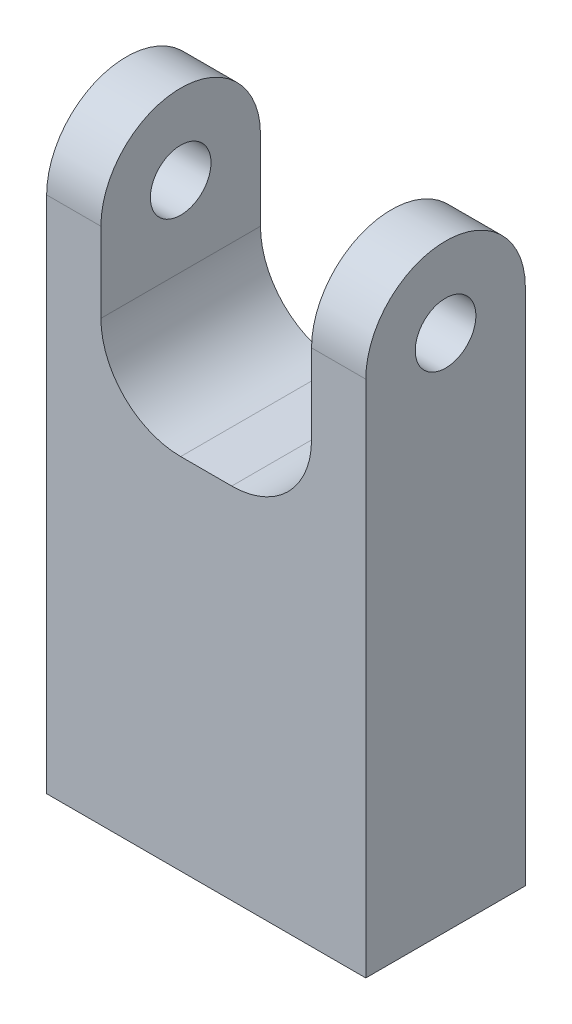
ISO-10303-21;
HEADER;
FILE_DESCRIPTION(('STEP AP214'),'2;1');
FILE_NAME('part.step','',(''),(''),'','','');
FILE_SCHEMA(('AUTOMOTIVE_DESIGN { 1 0 10303 214 1 1 1 1 }'));
ENDSEC;
DATA;
#1=APPLICATION_CONTEXT('core data for automotive mechanical design processes');
#2=APPLICATION_PROTOCOL_DEFINITION('international standard','automotive_design',2000,#1);
#3=PRODUCT_CONTEXT('',#1,'mechanical');
#4=PRODUCT('Part','Part','',(#3));
#5=PRODUCT_RELATED_PRODUCT_CATEGORY('part','',(#4));
#6=PRODUCT_DEFINITION_FORMATION('','',#4);
#7=PRODUCT_DEFINITION_CONTEXT('part definition',#1,'design');
#8=PRODUCT_DEFINITION('design','',#6,#7);
#9=PRODUCT_DEFINITION_SHAPE('','',#8);
#10=(LENGTH_UNIT() NAMED_UNIT(*) SI_UNIT(.MILLI.,.METRE.));
#11=(NAMED_UNIT(*) PLANE_ANGLE_UNIT() SI_UNIT($,.RADIAN.));
#12=(NAMED_UNIT(*) SI_UNIT($,.STERADIAN.) SOLID_ANGLE_UNIT());
#13=UNCERTAINTY_MEASURE_WITH_UNIT(LENGTH_MEASURE(1.E-05),#10,'distance_accuracy_value','');
#14=(GEOMETRIC_REPRESENTATION_CONTEXT(3) GLOBAL_UNCERTAINTY_ASSIGNED_CONTEXT((#13)) GLOBAL_UNIT_ASSIGNED_CONTEXT((#10,
#11,#12)) REPRESENTATION_CONTEXT('',''));
#15=CARTESIAN_POINT('',(0.,0.,0.));
#16=DIRECTION('',(0.,0.,1.));
#17=DIRECTION('',(1.,0.,0.));
#18=AXIS2_PLACEMENT_3D('',#15,#16,#17);
#19=CARTESIAN_POINT('',(8.38199999999999,41.275,0.));
#20=DIRECTION('',(-1.,0.,0.));
#21=DIRECTION('',(0.,-1.,0.));
#22=AXIS2_PLACEMENT_3D('',#19,#20,#21);
#23=CYLINDRICAL_SURFACE('',#22,6.35);
#24=DIRECTION('',(1.,0.,0.));
#25=VECTOR('',#24,1.);
#26=CARTESIAN_POINT('',(8.38199999999999,41.275,-6.35));
#27=LINE('',#26,#25);
#28=CARTESIAN_POINT('',(8.38199999999999,41.275,-6.35));
#29=VERTEX_POINT('',#28);
#30=CARTESIAN_POINT('',(12.7,41.275,-6.35));
#31=VERTEX_POINT('',#30);
#32=EDGE_CURVE('E203',#29,#31,#27,.T.);
#33=ORIENTED_EDGE('',*,*,#32,.F.);
#34=CARTESIAN_POINT('',(8.38199999999999,41.275,0.));
#35=DIRECTION('',(1.,0.,0.));
#36=DIRECTION('',(0.,1.,0.));
#37=AXIS2_PLACEMENT_3D('',#34,#35,#36);
#38=CIRCLE('',#37,6.35);
#39=CARTESIAN_POINT('',(8.38199999999999,41.275,6.35));
#40=VERTEX_POINT('',#39);
#41=EDGE_CURVE('E43',#40,#29,#38,.F.);
#42=ORIENTED_EDGE('',*,*,#41,.F.);
#43=DIRECTION('',(-1.,0.,0.));
#44=VECTOR('',#43,1.);
#45=CARTESIAN_POINT('',(0.,41.275,6.35));
#46=LINE('',#45,#44);
#47=CARTESIAN_POINT('',(12.7,41.275,6.35));
#48=VERTEX_POINT('',#47);
#49=EDGE_CURVE('E206',#48,#40,#46,.T.);
#50=ORIENTED_EDGE('',*,*,#49,.F.);
#51=CARTESIAN_POINT('',(12.7,41.275,0.));
#52=DIRECTION('',(-1.,0.,0.));
#53=DIRECTION('',(0.,-1.,0.));
#54=AXIS2_PLACEMENT_3D('',#51,#52,#53);
#55=CIRCLE('',#54,6.35);
#56=EDGE_CURVE('E11',#31,#48,#55,.F.);
#57=ORIENTED_EDGE('',*,*,#56,.F.);
#58=EDGE_LOOP('',(#33,#42,#50,#57));
#59=FACE_BOUND('',#58,.T.);
#60=ADVANCED_FACE('F36',(#59),#23,.T.);
#61=CARTESIAN_POINT('',(-12.7,41.275,0.));
#62=DIRECTION('',(-1.,0.,0.));
#63=DIRECTION('',(0.,-1.,0.));
#64=AXIS2_PLACEMENT_3D('',#61,#62,#63);
#65=CYLINDRICAL_SURFACE('',#64,6.35);
#66=DIRECTION('',(1.,0.,0.));
#67=VECTOR('',#66,1.);
#68=CARTESIAN_POINT('',(-12.7,41.275,-6.35));
#69=LINE('',#68,#67);
#70=CARTESIAN_POINT('',(-12.7,41.275,-6.35));
#71=VERTEX_POINT('',#70);
#72=CARTESIAN_POINT('',(-8.38199999999999,41.275,-6.35));
#73=VERTEX_POINT('',#72);
#74=EDGE_CURVE('E192',#71,#73,#69,.T.);
#75=ORIENTED_EDGE('',*,*,#74,.F.);
#76=CARTESIAN_POINT('',(-12.7,41.275,0.));
#77=DIRECTION('',(1.,0.,0.));
#78=DIRECTION('',(0.,1.,0.));
#79=AXIS2_PLACEMENT_3D('',#76,#77,#78);
#80=CIRCLE('',#79,6.35);
#81=CARTESIAN_POINT('',(-12.7,41.275,6.35));
#82=VERTEX_POINT('',#81);
#83=EDGE_CURVE('E201',#82,#71,#80,.F.);
#84=ORIENTED_EDGE('',*,*,#83,.F.);
#85=DIRECTION('',(-1.,0.,0.));
#86=VECTOR('',#85,1.);
#87=CARTESIAN_POINT('',(0.,41.275,6.35));
#88=LINE('',#87,#86);
#89=CARTESIAN_POINT('',(-8.38199999999999,41.275,6.35));
#90=VERTEX_POINT('',#89);
#91=EDGE_CURVE('E198',#90,#82,#88,.T.);
#92=ORIENTED_EDGE('',*,*,#91,.F.);
#93=CARTESIAN_POINT('',(-8.38199999999999,41.275,0.));
#94=DIRECTION('',(-1.,0.,0.));
#95=DIRECTION('',(0.,0.,1.));
#96=AXIS2_PLACEMENT_3D('',#93,#94,#95);
#97=CIRCLE('',#96,6.35);
#98=EDGE_CURVE('E195',#73,#90,#97,.F.);
#99=ORIENTED_EDGE('',*,*,#98,.F.);
#100=EDGE_LOOP('',(#75,#84,#92,#99));
#101=FACE_BOUND('',#100,.T.);
#102=ADVANCED_FACE('F236',(#101),#65,.T.);
#103=CARTESIAN_POINT('',(-12.7,0.,6.35));
#104=DIRECTION('',(1.,0.,0.));
#105=DIRECTION('',(0.,1.,0.));
#106=AXIS2_PLACEMENT_3D('',#103,#104,#105);
#107=PLANE('',#106);
#108=CARTESIAN_POINT('',(-12.7,41.275,0.));
#109=DIRECTION('',(1.,0.,0.));
#110=DIRECTION('',(0.,0.,-1.));
#111=AXIS2_PLACEMENT_3D('',#108,#109,#110);
#112=CIRCLE('',#111,2.41299999999999);
#113=CARTESIAN_POINT('',(-12.7,41.275,-2.41299999999999));
#114=VERTEX_POINT('',#113);
#115=EDGE_CURVE('E414',#114,#114,#112,.T.);
#116=ORIENTED_EDGE('',*,*,#115,.T.);
#117=EDGE_LOOP('',(#116));
#118=FACE_BOUND('',#117,.T.);
#119=DIRECTION('',(0.,-1.,0.));
#120=VECTOR('',#119,1.);
#121=CARTESIAN_POINT('',(-12.7,0.,6.35));
#122=LINE('',#121,#120);
#123=CARTESIAN_POINT('',(-12.7,0.,6.35));
#124=VERTEX_POINT('',#123);
#125=EDGE_CURVE('E138',#82,#124,#122,.T.);
#126=ORIENTED_EDGE('',*,*,#125,.F.);
#127=ORIENTED_EDGE('',*,*,#83,.T.);
#128=DIRECTION('',(0.,-1.,0.));
#129=VECTOR('',#128,1.);
#130=CARTESIAN_POINT('',(-12.7,0.,-6.35));
#131=LINE('',#130,#129);
#132=CARTESIAN_POINT('',(-12.7,0.,-6.35));
#133=VERTEX_POINT('',#132);
#134=EDGE_CURVE('E137',#71,#133,#131,.T.);
#135=ORIENTED_EDGE('',*,*,#134,.T.);
#136=DIRECTION('',(0.,0.,-1.));
#137=VECTOR('',#136,1.);
#138=CARTESIAN_POINT('',(-12.7,0.,6.35));
#139=LINE('',#138,#137);
#140=EDGE_CURVE('E169',#124,#133,#139,.T.);
#141=ORIENTED_EDGE('',*,*,#140,.F.);
#142=EDGE_LOOP('',(#126,#127,#135,#141));
#143=FACE_BOUND('',#142,.T.);
#144=ADVANCED_FACE('F242',(#118,#143),#107,.F.);
#145=CARTESIAN_POINT('',(-12.7,0.,6.35));
#146=DIRECTION('',(0.,1.,0.));
#147=DIRECTION('',(-1.,0.,0.));
#148=AXIS2_PLACEMENT_3D('',#145,#146,#147);
#149=PLANE('',#148);
#150=CARTESIAN_POINT('',(6.35,0.,0.));
#151=DIRECTION('',(0.,-1.,0.));
#152=DIRECTION('',(0.,0.,-1.));
#153=AXIS2_PLACEMENT_3D('',#150,#151,#152);
#154=CIRCLE('',#153,1.35254999999999);
#155=CARTESIAN_POINT('',(6.35,0.,-1.35254999999999));
#156=VERTEX_POINT('',#155);
#157=EDGE_CURVE('E125',#156,#156,#154,.T.);
#158=ORIENTED_EDGE('',*,*,#157,.F.);
#159=EDGE_LOOP('',(#158));
#160=FACE_BOUND('',#159,.T.);
#161=CARTESIAN_POINT('',(-6.35,0.,0.));
#162=DIRECTION('',(0.,-1.,0.));
#163=DIRECTION('',(0.,0.,-1.));
#164=AXIS2_PLACEMENT_3D('',#161,#162,#163);
#165=CIRCLE('',#164,1.35254999999999);
#166=CARTESIAN_POINT('',(-6.35,0.,-1.35254999999999));
#167=VERTEX_POINT('',#166);
#168=EDGE_CURVE('E124',#167,#167,#165,.T.);
#169=ORIENTED_EDGE('',*,*,#168,.F.);
#170=EDGE_LOOP('',(#169));
#171=FACE_BOUND('',#170,.T.);
#172=DIRECTION('',(1.,0.,0.));
#173=VECTOR('',#172,1.);
#174=CARTESIAN_POINT('',(-12.7,0.,-6.35));
#175=LINE('',#174,#173);
#176=CARTESIAN_POINT('',(12.7,0.,-6.35));
#177=VERTEX_POINT('',#176);
#178=EDGE_CURVE('E156',#133,#177,#175,.T.);
#179=ORIENTED_EDGE('',*,*,#178,.T.);
#180=DIRECTION('',(0.,0.,-1.));
#181=VECTOR('',#180,1.);
#182=CARTESIAN_POINT('',(12.7,0.,6.35));
#183=LINE('',#182,#181);
#184=CARTESIAN_POINT('',(12.7,0.,6.35));
#185=VERTEX_POINT('',#184);
#186=EDGE_CURVE('E154',#185,#177,#183,.T.);
#187=ORIENTED_EDGE('',*,*,#186,.F.);
#188=DIRECTION('',(1.,0.,0.));
#189=VECTOR('',#188,1.);
#190=CARTESIAN_POINT('',(-12.7,0.,6.35));
#191=LINE('',#190,#189);
#192=EDGE_CURVE('E140',#124,#185,#191,.T.);
#193=ORIENTED_EDGE('',*,*,#192,.F.);
#194=ORIENTED_EDGE('',*,*,#140,.T.);
#195=EDGE_LOOP('',(#179,#187,#193,#194));
#196=FACE_BOUND('',#195,.T.);
#197=ADVANCED_FACE('F246',(#160,#171,#196),#149,.F.);
#198=CARTESIAN_POINT('',(12.7,0.,6.35));
#199=DIRECTION('',(-1.,0.,0.));
#200=DIRECTION('',(0.,-1.,0.));
#201=AXIS2_PLACEMENT_3D('',#198,#199,#200);
#202=PLANE('',#201);
#203=CARTESIAN_POINT('',(12.7,41.275,0.));
#204=DIRECTION('',(1.,0.,0.));
#205=DIRECTION('',(0.,0.,-1.));
#206=AXIS2_PLACEMENT_3D('',#203,#204,#205);
#207=CIRCLE('',#206,2.413);
#208=CARTESIAN_POINT('',(12.7,41.275,-2.413));
#209=VERTEX_POINT('',#208);
#210=EDGE_CURVE('E418',#209,#209,#207,.T.);
#211=ORIENTED_EDGE('',*,*,#210,.F.);
#212=EDGE_LOOP('',(#211));
#213=FACE_BOUND('',#212,.T.);
#214=DIRECTION('',(0.,1.,0.));
#215=VECTOR('',#214,1.);
#216=CARTESIAN_POINT('',(12.7,0.,-6.35));
#217=LINE('',#216,#215);
#218=EDGE_CURVE('E158',#177,#31,#217,.T.);
#219=ORIENTED_EDGE('',*,*,#218,.T.);
#220=ORIENTED_EDGE('',*,*,#56,.T.);
#221=DIRECTION('',(0.,1.,0.));
#222=VECTOR('',#221,1.);
#223=CARTESIAN_POINT('',(12.7,0.,6.35));
#224=LINE('',#223,#222);
#225=EDGE_CURVE('E143',#185,#48,#224,.T.);
#226=ORIENTED_EDGE('',*,*,#225,.F.);
#227=ORIENTED_EDGE('',*,*,#186,.T.);
#228=EDGE_LOOP('',(#219,#220,#226,#227));
#229=FACE_BOUND('',#228,.T.);
#230=ADVANCED_FACE('F247',(#213,#229),#202,.F.);
#231=CARTESIAN_POINT('',(8.38199999999999,47.625,6.35));
#232=DIRECTION('',(1.,0.,0.));
#233=DIRECTION('',(0.,1.,0.));
#234=AXIS2_PLACEMENT_3D('',#231,#232,#233);
#235=PLANE('',#234);
#236=CARTESIAN_POINT('',(8.38199999999999,41.275,0.));
#237=DIRECTION('',(1.,0.,0.));
#238=DIRECTION('',(0.,1.,0.));
#239=AXIS2_PLACEMENT_3D('',#236,#237,#238);
#240=CIRCLE('',#239,2.41299999999999);
#241=CARTESIAN_POINT('',(8.38199999999999,43.688,0.));
#242=VERTEX_POINT('',#241);
#243=EDGE_CURVE('E131',#242,#242,#240,.T.);
#244=ORIENTED_EDGE('',*,*,#243,.T.);
#245=EDGE_LOOP('',(#244));
#246=FACE_BOUND('',#245,.T.);
#247=DIRECTION('',(0.,-1.,0.));
#248=VECTOR('',#247,1.);
#249=CARTESIAN_POINT('',(8.38199999999999,47.625,6.35));
#250=LINE('',#249,#248);
#251=CARTESIAN_POINT('',(8.38199999999999,34.925,6.35));
#252=VERTEX_POINT('',#251);
#253=EDGE_CURVE('E146',#40,#252,#250,.T.);
#254=ORIENTED_EDGE('',*,*,#253,.F.);
#255=ORIENTED_EDGE('',*,*,#41,.T.);
#256=DIRECTION('',(0.,-1.,0.));
#257=VECTOR('',#256,1.);
#258=CARTESIAN_POINT('',(8.38199999999999,47.625,-6.35));
#259=LINE('',#258,#257);
#260=CARTESIAN_POINT('',(8.38199999999999,34.925,-6.35));
#261=VERTEX_POINT('',#260);
#262=EDGE_CURVE('E160',#29,#261,#259,.T.);
#263=ORIENTED_EDGE('',*,*,#262,.T.);
#264=DIRECTION('',(0.,0.,-1.));
#265=VECTOR('',#264,1.);
#266=CARTESIAN_POINT('',(8.38199999999999,34.925,6.35));
#267=LINE('',#266,#265);
#268=EDGE_CURVE('E180',#261,#252,#267,.F.);
#269=ORIENTED_EDGE('',*,*,#268,.T.);
#270=EDGE_LOOP('',(#254,#255,#263,#269));
#271=FACE_BOUND('',#270,.T.);
#272=ADVANCED_FACE('F209',(#246,#271),#235,.F.);
#273=CARTESIAN_POINT('',(-8.38199999999999,28.575,6.35));
#274=DIRECTION('',(0.,-1.,0.));
#275=DIRECTION('',(1.,0.,0.));
#276=AXIS2_PLACEMENT_3D('',#273,#274,#275);
#277=PLANE('',#276);
#278=DIRECTION('',(-1.,0.,0.));
#279=VECTOR('',#278,1.);
#280=CARTESIAN_POINT('',(-8.38199999999999,28.575,-6.35));
#281=LINE('',#280,#279);
#282=CARTESIAN_POINT('',(2.03199999999999,28.575,-6.35));
#283=VERTEX_POINT('',#282);
#284=CARTESIAN_POINT('',(-2.03199999999999,28.575,-6.35));
#285=VERTEX_POINT('',#284);
#286=EDGE_CURVE('E162',#283,#285,#281,.T.);
#287=ORIENTED_EDGE('',*,*,#286,.T.);
#288=DIRECTION('',(0.,0.,-1.));
#289=VECTOR('',#288,1.);
#290=CARTESIAN_POINT('',(-2.03199999999999,28.575,6.35));
#291=LINE('',#290,#289);
#292=CARTESIAN_POINT('',(-2.03199999999999,28.575,6.35));
#293=VERTEX_POINT('',#292);
#294=EDGE_CURVE('E178',#285,#293,#291,.F.);
#295=ORIENTED_EDGE('',*,*,#294,.T.);
#296=DIRECTION('',(-1.,0.,0.));
#297=VECTOR('',#296,1.);
#298=CARTESIAN_POINT('',(-8.38199999999999,28.575,6.35));
#299=LINE('',#298,#297);
#300=CARTESIAN_POINT('',(2.03199999999999,28.575,6.35));
#301=VERTEX_POINT('',#300);
#302=EDGE_CURVE('E148',#301,#293,#299,.T.);
#303=ORIENTED_EDGE('',*,*,#302,.F.);
#304=DIRECTION('',(0.,0.,-1.));
#305=VECTOR('',#304,1.);
#306=CARTESIAN_POINT('',(2.03199999999999,28.575,-6.35));
#307=LINE('',#306,#305);
#308=EDGE_CURVE('E175',#301,#283,#307,.T.);
#309=ORIENTED_EDGE('',*,*,#308,.T.);
#310=EDGE_LOOP('',(#287,#295,#303,#309));
#311=FACE_BOUND('',#310,.T.);
#312=ADVANCED_FACE('F225',(#311),#277,.F.);
#313=CARTESIAN_POINT('',(-8.38199999999999,47.625,6.35));
#314=DIRECTION('',(-1.,0.,0.));
#315=DIRECTION('',(0.,0.,1.));
#316=AXIS2_PLACEMENT_3D('',#313,#314,#315);
#317=PLANE('',#316);
#318=CARTESIAN_POINT('',(-8.38199999999999,41.275,0.));
#319=DIRECTION('',(-1.,0.,0.));
#320=DIRECTION('',(0.,0.,1.));
#321=AXIS2_PLACEMENT_3D('',#318,#319,#320);
#322=CIRCLE('',#321,2.41299999999999);
#323=CARTESIAN_POINT('',(-8.38199999999999,41.275,2.41299999999999));
#324=VERTEX_POINT('',#323);
#325=EDGE_CURVE('E412',#324,#324,#322,.T.);
#326=ORIENTED_EDGE('',*,*,#325,.T.);
#327=EDGE_LOOP('',(#326));
#328=FACE_BOUND('',#327,.T.);
#329=DIRECTION('',(0.,1.,0.));
#330=VECTOR('',#329,1.);
#331=CARTESIAN_POINT('',(-8.38199999999999,47.625,-6.35));
#332=LINE('',#331,#330);
#333=CARTESIAN_POINT('',(-8.38199999999999,34.925,-6.35));
#334=VERTEX_POINT('',#333);
#335=EDGE_CURVE('E141',#334,#73,#332,.T.);
#336=ORIENTED_EDGE('',*,*,#335,.T.);
#337=ORIENTED_EDGE('',*,*,#98,.T.);
#338=DIRECTION('',(0.,1.,0.));
#339=VECTOR('',#338,1.);
#340=CARTESIAN_POINT('',(-8.38199999999999,47.625,6.35));
#341=LINE('',#340,#339);
#342=CARTESIAN_POINT('',(-8.38199999999999,34.925,6.35));
#343=VERTEX_POINT('',#342);
#344=EDGE_CURVE('E151',#343,#90,#341,.T.);
#345=ORIENTED_EDGE('',*,*,#344,.F.);
#346=DIRECTION('',(0.,0.,-1.));
#347=VECTOR('',#346,1.);
#348=CARTESIAN_POINT('',(-8.38199999999999,34.925,-6.35));
#349=LINE('',#348,#347);
#350=EDGE_CURVE('E172',#343,#334,#349,.T.);
#351=ORIENTED_EDGE('',*,*,#350,.T.);
#352=EDGE_LOOP('',(#336,#337,#345,#351));
#353=FACE_BOUND('',#352,.T.);
#354=ADVANCED_FACE('F232',(#328,#353),#317,.F.);
#355=CARTESIAN_POINT('',(0.,0.,6.35));
#356=DIRECTION('',(0.,0.,-1.));
#357=DIRECTION('',(-1.,0.,0.));
#358=AXIS2_PLACEMENT_3D('',#355,#356,#357);
#359=PLANE('',#358);
#360=ORIENTED_EDGE('',*,*,#225,.T.);
#361=ORIENTED_EDGE('',*,*,#49,.T.);
#362=ORIENTED_EDGE('',*,*,#253,.T.);
#363=CARTESIAN_POINT('',(2.03199999999999,34.925,6.35));
#364=DIRECTION('',(0.,0.,-1.));
#365=DIRECTION('',(-1.,0.,0.));
#366=AXIS2_PLACEMENT_3D('',#363,#364,#365);
#367=CIRCLE('',#366,6.35);
#368=EDGE_CURVE('E190',#252,#301,#367,.T.);
#369=ORIENTED_EDGE('',*,*,#368,.T.);
#370=ORIENTED_EDGE('',*,*,#302,.T.);
#371=CARTESIAN_POINT('',(-2.03199999999999,34.925,6.35));
#372=DIRECTION('',(0.,0.,-1.));
#373=DIRECTION('',(-1.,0.,0.));
#374=AXIS2_PLACEMENT_3D('',#371,#372,#373);
#375=CIRCLE('',#374,6.35);
#376=EDGE_CURVE('E185',#293,#343,#375,.T.);
#377=ORIENTED_EDGE('',*,*,#376,.T.);
#378=ORIENTED_EDGE('',*,*,#344,.T.);
#379=ORIENTED_EDGE('',*,*,#91,.T.);
#380=ORIENTED_EDGE('',*,*,#125,.T.);
#381=ORIENTED_EDGE('',*,*,#192,.T.);
#382=EDGE_LOOP('',(#360,#361,#362,#369,#370,#377,#378,#379,#380,#381));
#383=FACE_BOUND('',#382,.T.);
#384=ADVANCED_FACE('F222',(#383),#359,.F.);
#385=CARTESIAN_POINT('',(0.,0.,-6.35));
#386=DIRECTION('',(0.,0.,-1.));
#387=DIRECTION('',(-1.,0.,0.));
#388=AXIS2_PLACEMENT_3D('',#385,#386,#387);
#389=PLANE('',#388);
#390=ORIENTED_EDGE('',*,*,#262,.F.);
#391=ORIENTED_EDGE('',*,*,#32,.T.);
#392=ORIENTED_EDGE('',*,*,#218,.F.);
#393=ORIENTED_EDGE('',*,*,#178,.F.);
#394=ORIENTED_EDGE('',*,*,#134,.F.);
#395=ORIENTED_EDGE('',*,*,#74,.T.);
#396=ORIENTED_EDGE('',*,*,#335,.F.);
#397=CARTESIAN_POINT('',(-2.03199999999999,34.925,-6.35));
#398=DIRECTION('',(0.,0.,-1.));
#399=DIRECTION('',(-1.,0.,0.));
#400=AXIS2_PLACEMENT_3D('',#397,#398,#399);
#401=CIRCLE('',#400,6.35);
#402=EDGE_CURVE('E183',#334,#285,#401,.F.);
#403=ORIENTED_EDGE('',*,*,#402,.T.);
#404=ORIENTED_EDGE('',*,*,#286,.F.);
#405=CARTESIAN_POINT('',(2.03199999999999,34.925,-6.35));
#406=DIRECTION('',(0.,0.,-1.));
#407=DIRECTION('',(-1.,0.,0.));
#408=AXIS2_PLACEMENT_3D('',#405,#406,#407);
#409=CIRCLE('',#408,6.35);
#410=EDGE_CURVE('E187',#283,#261,#409,.F.);
#411=ORIENTED_EDGE('',*,*,#410,.T.);
#412=EDGE_LOOP('',(#390,#391,#392,#393,#394,#395,#396,#403,#404,#411));
#413=FACE_BOUND('',#412,.T.);
#414=ADVANCED_FACE('F213',(#413),#389,.T.);
#415=CARTESIAN_POINT('',(-6.35,8.636,0.));
#416=DIRECTION('',(0.,-1.,0.));
#417=DIRECTION('',(0.,0.,-1.));
#418=AXIS2_PLACEMENT_3D('',#415,#416,#417);
#419=CONICAL_SURFACE('',#418,1.35255,1.02974425867665);
#420=CARTESIAN_POINT('',(-6.35,9.44869403026573,0.));
#421=VERTEX_POINT('',#420);
#422=VERTEX_LOOP('',#421);
#423=FACE_BOUND('',#422,.T.);
#424=CARTESIAN_POINT('',(-6.35,8.636,0.));
#425=DIRECTION('',(0.,-1.,0.));
#426=DIRECTION('',(0.,0.,-1.));
#427=AXIS2_PLACEMENT_3D('',#424,#425,#426);
#428=CIRCLE('',#427,1.35255);
#429=CARTESIAN_POINT('',(-6.35,8.636,-1.35255));
#430=VERTEX_POINT('',#429);
#431=EDGE_CURVE('E128',#430,#430,#428,.T.);
#432=ORIENTED_EDGE('',*,*,#431,.T.);
#433=EDGE_LOOP('',(#432));
#434=FACE_BOUND('',#433,.T.);
#435=ADVANCED_FACE('F291',(#423,#434),#419,.F.);
#436=CARTESIAN_POINT('',(-6.35,0.,0.));
#437=DIRECTION('',(0.,-1.,0.));
#438=DIRECTION('',(0.,0.,-1.));
#439=AXIS2_PLACEMENT_3D('',#436,#437,#438);
#440=CYLINDRICAL_SURFACE('',#439,1.35254999999999);
#441=ORIENTED_EDGE('',*,*,#431,.F.);
#442=EDGE_LOOP('',(#441));
#443=FACE_BOUND('',#442,.T.);
#444=ORIENTED_EDGE('',*,*,#168,.T.);
#445=EDGE_LOOP('',(#444));
#446=FACE_BOUND('',#445,.T.);
#447=ADVANCED_FACE('F118',(#443,#446),#440,.F.);
#448=CARTESIAN_POINT('',(6.35,8.636,0.));
#449=DIRECTION('',(0.,-1.,0.));
#450=DIRECTION('',(0.,0.,-1.));
#451=AXIS2_PLACEMENT_3D('',#448,#449,#450);
#452=CONICAL_SURFACE('',#451,1.35255,1.02974425867665);
#453=CARTESIAN_POINT('',(6.35,9.44869403026573,0.));
#454=VERTEX_POINT('',#453);
#455=VERTEX_LOOP('',#454);
#456=FACE_BOUND('',#455,.T.);
#457=CARTESIAN_POINT('',(6.35,8.636,0.));
#458=DIRECTION('',(0.,-1.,0.));
#459=DIRECTION('',(0.,0.,-1.));
#460=AXIS2_PLACEMENT_3D('',#457,#458,#459);
#461=CIRCLE('',#460,1.35255);
#462=CARTESIAN_POINT('',(6.35,8.636,-1.35255));
#463=VERTEX_POINT('',#462);
#464=EDGE_CURVE('E122',#463,#463,#461,.T.);
#465=ORIENTED_EDGE('',*,*,#464,.T.);
#466=EDGE_LOOP('',(#465));
#467=FACE_BOUND('',#466,.T.);
#468=ADVANCED_FACE('F114',(#456,#467),#452,.F.);
#469=CARTESIAN_POINT('',(6.35,0.,0.));
#470=DIRECTION('',(0.,-1.,0.));
#471=DIRECTION('',(0.,0.,-1.));
#472=AXIS2_PLACEMENT_3D('',#469,#470,#471);
#473=CYLINDRICAL_SURFACE('',#472,1.35254999999999);
#474=ORIENTED_EDGE('',*,*,#464,.F.);
#475=EDGE_LOOP('',(#474));
#476=FACE_BOUND('',#475,.T.);
#477=ORIENTED_EDGE('',*,*,#157,.T.);
#478=EDGE_LOOP('',(#477));
#479=FACE_BOUND('',#478,.T.);
#480=ADVANCED_FACE('F117',(#476,#479),#473,.F.);
#481=CARTESIAN_POINT('',(12.7,41.275,0.));
#482=DIRECTION('',(1.,0.,0.));
#483=DIRECTION('',(0.,0.,-1.));
#484=AXIS2_PLACEMENT_3D('',#481,#482,#483);
#485=CYLINDRICAL_SURFACE('',#484,2.41299999999999);
#486=ORIENTED_EDGE('',*,*,#115,.F.);
#487=EDGE_LOOP('',(#486));
#488=FACE_BOUND('',#487,.T.);
#489=ORIENTED_EDGE('',*,*,#325,.F.);
#490=EDGE_LOOP('',(#489));
#491=FACE_BOUND('',#490,.T.);
#492=ADVANCED_FACE('F277',(#488,#491),#485,.F.);
#493=ORIENTED_EDGE('',*,*,#210,.T.);
#494=EDGE_LOOP('',(#493));
#495=FACE_BOUND('',#494,.T.);
#496=ORIENTED_EDGE('',*,*,#243,.F.);
#497=EDGE_LOOP('',(#496));
#498=FACE_BOUND('',#497,.T.);
#499=ADVANCED_FACE('F273',(#495,#498),#485,.F.);
#500=CARTESIAN_POINT('',(-2.03199999999999,34.925,6.35));
#501=DIRECTION('',(0.,0.,1.));
#502=DIRECTION('',(1.,0.,0.));
#503=AXIS2_PLACEMENT_3D('',#500,#501,#502);
#504=CYLINDRICAL_SURFACE('',#503,6.35);
#505=ORIENTED_EDGE('',*,*,#376,.F.);
#506=ORIENTED_EDGE('',*,*,#294,.F.);
#507=ORIENTED_EDGE('',*,*,#402,.F.);
#508=ORIENTED_EDGE('',*,*,#350,.F.);
#509=EDGE_LOOP('',(#505,#506,#507,#508));
#510=FACE_BOUND('',#509,.T.);
#511=ADVANCED_FACE('F228',(#510),#504,.F.);
#512=CARTESIAN_POINT('',(2.03199999999999,34.925,6.35));
#513=DIRECTION('',(0.,0.,1.));
#514=DIRECTION('',(1.,0.,0.));
#515=AXIS2_PLACEMENT_3D('',#512,#513,#514);
#516=CYLINDRICAL_SURFACE('',#515,6.35);
#517=ORIENTED_EDGE('',*,*,#368,.F.);
#518=ORIENTED_EDGE('',*,*,#268,.F.);
#519=ORIENTED_EDGE('',*,*,#410,.F.);
#520=ORIENTED_EDGE('',*,*,#308,.F.);
#521=EDGE_LOOP('',(#517,#518,#519,#520));
#522=FACE_BOUND('',#521,.T.);
#523=ADVANCED_FACE('F219',(#522),#516,.F.);
#524=CLOSED_SHELL('',(#60,#102,#144,#197,#230,#272,#312,#354,#384,#414,#435,#447,#468,#480,#492,
#499,#511,#523));
#525=MANIFOLD_SOLID_BREP('B2',#524);
#526=ADVANCED_BREP_SHAPE_REPRESENTATION('',(#18,#525),#14);
#527=SHAPE_DEFINITION_REPRESENTATION(#9,#526);
ENDSEC;
END-ISO-10303-21;
